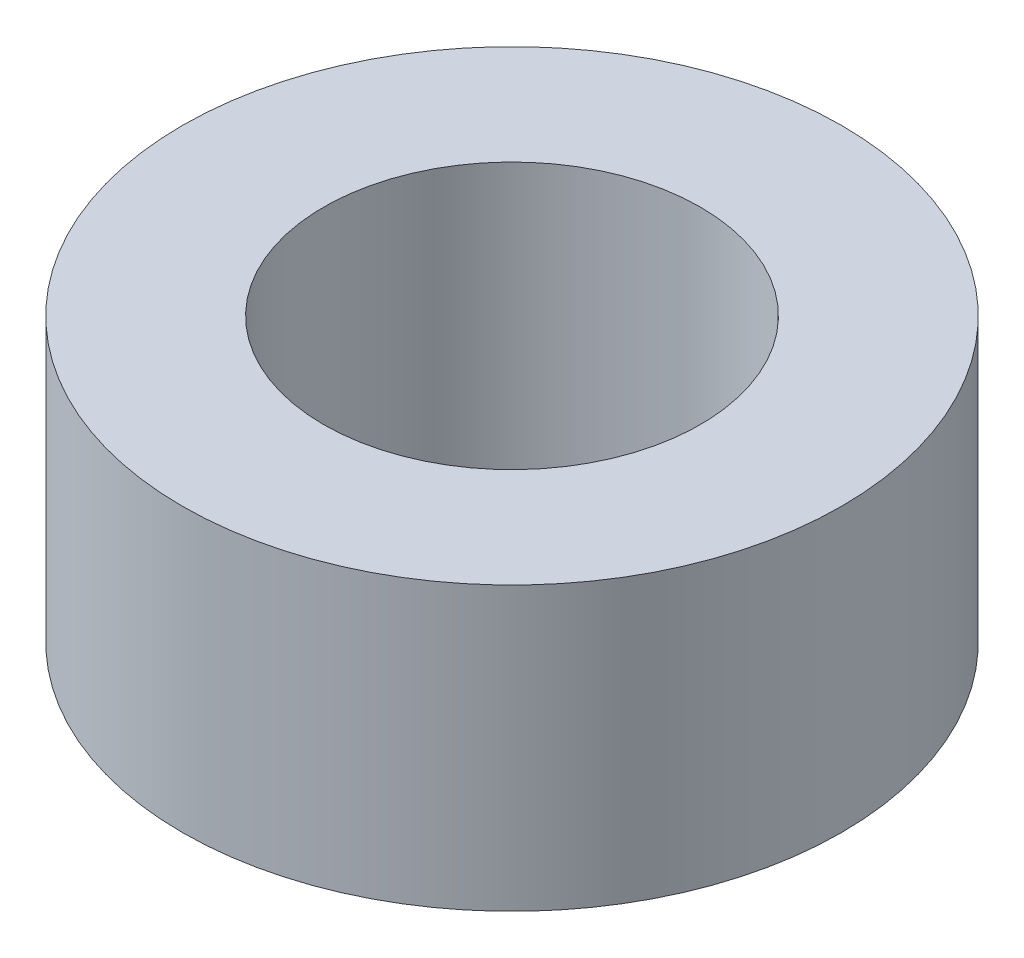
ISO-10303-21;
HEADER;
FILE_DESCRIPTION(('STEP AP214'),'2;1');
FILE_NAME('part.step','',(''),(''),'','','');
FILE_SCHEMA(('AUTOMOTIVE_DESIGN { 1 0 10303 214 1 1 1 1 }'));
ENDSEC;
DATA;
#1=APPLICATION_CONTEXT('core data for automotive mechanical design processes');
#2=APPLICATION_PROTOCOL_DEFINITION('international standard','automotive_design',2000,#1);
#3=PRODUCT_CONTEXT('',#1,'mechanical');
#4=PRODUCT('Part','Part','',(#3));
#5=PRODUCT_RELATED_PRODUCT_CATEGORY('part','',(#4));
#6=PRODUCT_DEFINITION_FORMATION('','',#4);
#7=PRODUCT_DEFINITION_CONTEXT('part definition',#1,'design');
#8=PRODUCT_DEFINITION('design','',#6,#7);
#9=PRODUCT_DEFINITION_SHAPE('','',#8);
#10=(LENGTH_UNIT() NAMED_UNIT(*) SI_UNIT(.MILLI.,.METRE.));
#11=(NAMED_UNIT(*) PLANE_ANGLE_UNIT() SI_UNIT($,.RADIAN.));
#12=(NAMED_UNIT(*) SI_UNIT($,.STERADIAN.) SOLID_ANGLE_UNIT());
#13=UNCERTAINTY_MEASURE_WITH_UNIT(LENGTH_MEASURE(1.E-05),#10,'distance_accuracy_value','');
#14=(GEOMETRIC_REPRESENTATION_CONTEXT(3) GLOBAL_UNCERTAINTY_ASSIGNED_CONTEXT((#13)) GLOBAL_UNIT_ASSIGNED_CONTEXT((#10,
#11,#12)) REPRESENTATION_CONTEXT('',''));
#15=CARTESIAN_POINT('',(0.,0.,0.));
#16=DIRECTION('',(0.,0.,1.));
#17=DIRECTION('',(1.,0.,0.));
#18=AXIS2_PLACEMENT_3D('',#15,#16,#17);
#19=CARTESIAN_POINT('',(0.,3.,0.));
#20=DIRECTION('',(0.,1.,0.));
#21=DIRECTION('',(0.,0.,1.));
#22=AXIS2_PLACEMENT_3D('',#19,#20,#21);
#23=PLANE('',#22);
#24=CARTESIAN_POINT('',(0.,3.,0.));
#25=DIRECTION('',(0.,1.,0.));
#26=DIRECTION('',(0.,0.,1.));
#27=AXIS2_PLACEMENT_3D('',#24,#25,#26);
#28=CIRCLE('',#27,3.5);
#29=CARTESIAN_POINT('',(0.,3.,3.5));
#30=VERTEX_POINT('',#29);
#31=EDGE_CURVE('E10',#30,#30,#28,.T.);
#32=ORIENTED_EDGE('',*,*,#31,.T.);
#33=EDGE_LOOP('',(#32));
#34=FACE_BOUND('',#33,.T.);
#35=CARTESIAN_POINT('',(0.,3.,0.));
#36=DIRECTION('',(0.,1.,0.));
#37=DIRECTION('',(0.,0.,1.));
#38=AXIS2_PLACEMENT_3D('',#35,#36,#37);
#39=CIRCLE('',#38,2.);
#40=CARTESIAN_POINT('',(0.,3.,2.));
#41=VERTEX_POINT('',#40);
#42=EDGE_CURVE('E43',#41,#41,#39,.T.);
#43=ORIENTED_EDGE('',*,*,#42,.F.);
#44=EDGE_LOOP('',(#43));
#45=FACE_BOUND('',#44,.T.);
#46=ADVANCED_FACE('F32',(#34,#45),#23,.T.);
#47=CARTESIAN_POINT('',(0.,0.,0.));
#48=DIRECTION('',(0.,1.,0.));
#49=DIRECTION('',(0.,0.,1.));
#50=AXIS2_PLACEMENT_3D('',#47,#48,#49);
#51=PLANE('',#50);
#52=CARTESIAN_POINT('',(0.,0.,0.));
#53=DIRECTION('',(0.,1.,0.));
#54=DIRECTION('',(0.,0.,1.));
#55=AXIS2_PLACEMENT_3D('',#52,#53,#54);
#56=CIRCLE('',#55,3.5);
#57=CARTESIAN_POINT('',(0.,0.,3.5));
#58=VERTEX_POINT('',#57);
#59=EDGE_CURVE('E36',#58,#58,#56,.T.);
#60=ORIENTED_EDGE('',*,*,#59,.F.);
#61=EDGE_LOOP('',(#60));
#62=FACE_BOUND('',#61,.T.);
#63=CARTESIAN_POINT('',(0.,0.,0.));
#64=DIRECTION('',(0.,1.,0.));
#65=DIRECTION('',(0.,0.,1.));
#66=AXIS2_PLACEMENT_3D('',#63,#64,#65);
#67=CIRCLE('',#66,2.);
#68=CARTESIAN_POINT('',(0.,0.,2.));
#69=VERTEX_POINT('',#68);
#70=EDGE_CURVE('E45',#69,#69,#67,.T.);
#71=ORIENTED_EDGE('',*,*,#70,.T.);
#72=EDGE_LOOP('',(#71));
#73=FACE_BOUND('',#72,.T.);
#74=ADVANCED_FACE('F55',(#62,#73),#51,.F.);
#75=CARTESIAN_POINT('',(0.,3.,0.));
#76=DIRECTION('',(0.,-1.,0.));
#77=DIRECTION('',(0.,0.,-1.));
#78=AXIS2_PLACEMENT_3D('',#75,#76,#77);
#79=CYLINDRICAL_SURFACE('',#78,3.5);
#80=ORIENTED_EDGE('',*,*,#31,.F.);
#81=EDGE_LOOP('',(#80));
#82=FACE_BOUND('',#81,.T.);
#83=ORIENTED_EDGE('',*,*,#59,.T.);
#84=EDGE_LOOP('',(#83));
#85=FACE_BOUND('',#84,.T.);
#86=ADVANCED_FACE('F34',(#82,#85),#79,.T.);
#87=CARTESIAN_POINT('',(0.,3.,0.));
#88=DIRECTION('',(0.,-1.,0.));
#89=DIRECTION('',(0.,0.,-1.));
#90=AXIS2_PLACEMENT_3D('',#87,#88,#89);
#91=CYLINDRICAL_SURFACE('',#90,2.);
#92=ORIENTED_EDGE('',*,*,#42,.T.);
#93=EDGE_LOOP('',(#92));
#94=FACE_BOUND('',#93,.T.);
#95=ORIENTED_EDGE('',*,*,#70,.F.);
#96=EDGE_LOOP('',(#95));
#97=FACE_BOUND('',#96,.T.);
#98=ADVANCED_FACE('F51',(#94,#97),#91,.F.);
#99=CLOSED_SHELL('',(#46,#74,#86,#98));
#100=MANIFOLD_SOLID_BREP('B2',#99);
#101=ADVANCED_BREP_SHAPE_REPRESENTATION('',(#18,#100),#14);
#102=SHAPE_DEFINITION_REPRESENTATION(#9,#101);
ENDSEC;
END-ISO-10303-21;
